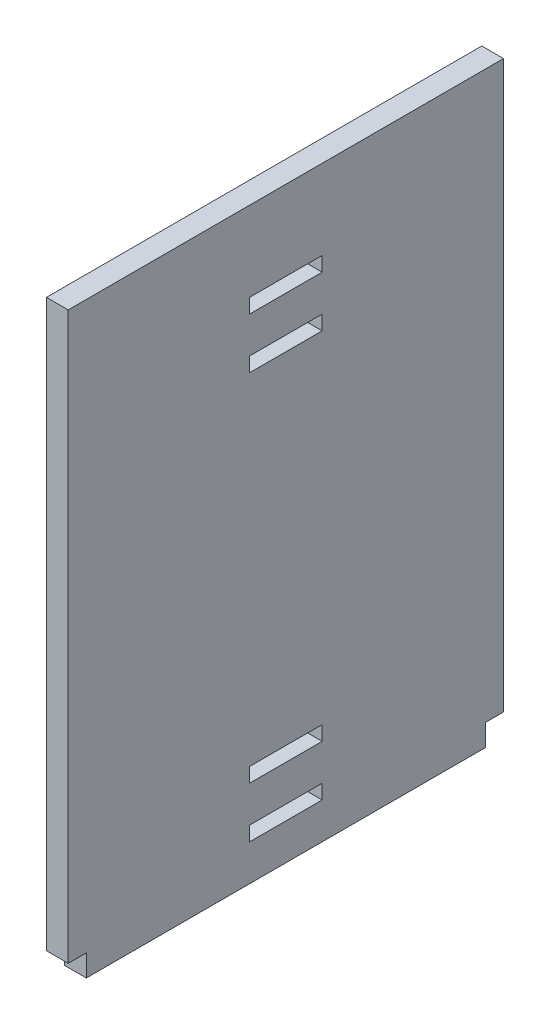
ISO-10303-21;
HEADER;
FILE_DESCRIPTION(('STEP AP214'),'2;1');
FILE_NAME('part.step','',(''),(''),'','','');
FILE_SCHEMA(('AUTOMOTIVE_DESIGN { 1 0 10303 214 1 1 1 1 }'));
ENDSEC;
DATA;
#1=APPLICATION_CONTEXT('core data for automotive mechanical design processes');
#2=APPLICATION_PROTOCOL_DEFINITION('international standard','automotive_design',2000,#1);
#3=PRODUCT_CONTEXT('',#1,'mechanical');
#4=PRODUCT('Part','Part','',(#3));
#5=PRODUCT_RELATED_PRODUCT_CATEGORY('part','',(#4));
#6=PRODUCT_DEFINITION_FORMATION('','',#4);
#7=PRODUCT_DEFINITION_CONTEXT('part definition',#1,'design');
#8=PRODUCT_DEFINITION('design','',#6,#7);
#9=PRODUCT_DEFINITION_SHAPE('','',#8);
#10=(LENGTH_UNIT() NAMED_UNIT(*) SI_UNIT(.MILLI.,.METRE.));
#11=(NAMED_UNIT(*) PLANE_ANGLE_UNIT() SI_UNIT($,.RADIAN.));
#12=(NAMED_UNIT(*) SI_UNIT($,.STERADIAN.) SOLID_ANGLE_UNIT());
#13=UNCERTAINTY_MEASURE_WITH_UNIT(LENGTH_MEASURE(1.E-05),#10,'distance_accuracy_value','');
#14=(GEOMETRIC_REPRESENTATION_CONTEXT(3) GLOBAL_UNCERTAINTY_ASSIGNED_CONTEXT((#13)) GLOBAL_UNIT_ASSIGNED_CONTEXT((#10,
#11,#12)) REPRESENTATION_CONTEXT('',''));
#15=CARTESIAN_POINT('',(0.,0.,0.));
#16=DIRECTION('',(0.,0.,1.));
#17=DIRECTION('',(1.,0.,0.));
#18=AXIS2_PLACEMENT_3D('',#15,#16,#17);
#19=CARTESIAN_POINT('',(0.,-81.,66.));
#20=DIRECTION('',(0.,0.,-1.));
#21=DIRECTION('',(-1.,0.,0.));
#22=AXIS2_PLACEMENT_3D('',#19,#20,#21);
#23=PLANE('',#22);
#24=DIRECTION('',(-1.,0.,0.));
#25=VECTOR('',#24,1.);
#26=CARTESIAN_POINT('',(0.,-75.,66.));
#27=LINE('',#26,#25);
#28=CARTESIAN_POINT('',(6.,-75.,66.));
#29=VERTEX_POINT('',#28);
#30=CARTESIAN_POINT('',(0.,-75.,66.));
#31=VERTEX_POINT('',#30);
#32=EDGE_CURVE('E11',#29,#31,#27,.T.);
#33=ORIENTED_EDGE('',*,*,#32,.F.);
#34=DIRECTION('',(0.,1.,0.));
#35=VECTOR('',#34,1.);
#36=CARTESIAN_POINT('',(6.,-81.,66.));
#37=LINE('',#36,#35);
#38=CARTESIAN_POINT('',(6.,81.,66.));
#39=VERTEX_POINT('',#38);
#40=EDGE_CURVE('E368',#29,#39,#37,.T.);
#41=ORIENTED_EDGE('',*,*,#40,.T.);
#42=DIRECTION('',(-1.,0.,0.));
#43=VECTOR('',#42,1.);
#44=CARTESIAN_POINT('',(0.,81.,66.));
#45=LINE('',#44,#43);
#46=CARTESIAN_POINT('',(0.,81.,66.));
#47=VERTEX_POINT('',#46);
#48=EDGE_CURVE('E341',#39,#47,#45,.T.);
#49=ORIENTED_EDGE('',*,*,#48,.T.);
#50=DIRECTION('',(0.,1.,0.));
#51=VECTOR('',#50,1.);
#52=CARTESIAN_POINT('',(0.,-81.,66.));
#53=LINE('',#52,#51);
#54=EDGE_CURVE('E361',#31,#47,#53,.T.);
#55=ORIENTED_EDGE('',*,*,#54,.F.);
#56=EDGE_LOOP('',(#33,#41,#49,#55));
#57=FACE_BOUND('',#56,.T.);
#58=ADVANCED_FACE('F33',(#57),#23,.F.);
#59=CARTESIAN_POINT('',(6.,81.,67.5));
#60=DIRECTION('',(0.,-1.,0.));
#61=DIRECTION('',(0.,0.,-1.));
#62=AXIS2_PLACEMENT_3D('',#59,#60,#61);
#63=PLANE('',#62);
#64=DIRECTION('',(0.,0.,1.));
#65=VECTOR('',#64,1.);
#66=CARTESIAN_POINT('',(6.,81.,67.5));
#67=LINE('',#66,#65);
#68=CARTESIAN_POINT('',(6.,81.,-54.));
#69=VERTEX_POINT('',#68);
#70=EDGE_CURVE('E371',#69,#39,#67,.T.);
#71=ORIENTED_EDGE('',*,*,#70,.F.);
#72=DIRECTION('',(1.,0.,0.));
#73=VECTOR('',#72,1.);
#74=CARTESIAN_POINT('',(6.,81.,-54.));
#75=LINE('',#74,#73);
#76=CARTESIAN_POINT('',(0.,81.,-54.));
#77=VERTEX_POINT('',#76);
#78=EDGE_CURVE('E357',#77,#69,#75,.T.);
#79=ORIENTED_EDGE('',*,*,#78,.F.);
#80=DIRECTION('',(0.,0.,1.));
#81=VECTOR('',#80,1.);
#82=CARTESIAN_POINT('',(0.,81.,67.5));
#83=LINE('',#82,#81);
#84=EDGE_CURVE('E364',#77,#47,#83,.T.);
#85=ORIENTED_EDGE('',*,*,#84,.T.);
#86=ORIENTED_EDGE('',*,*,#48,.F.);
#87=EDGE_LOOP('',(#71,#79,#85,#86));
#88=FACE_BOUND('',#87,.T.);
#89=ADVANCED_FACE('F35',(#88),#63,.F.);
#90=CARTESIAN_POINT('',(6.,-81.,67.5));
#91=DIRECTION('',(0.,1.,0.));
#92=DIRECTION('',(0.,0.,1.));
#93=AXIS2_PLACEMENT_3D('',#90,#91,#92);
#94=PLANE('',#93);
#95=DIRECTION('',(0.,0.,-1.));
#96=VECTOR('',#95,1.);
#97=CARTESIAN_POINT('',(6.,-81.,67.5));
#98=LINE('',#97,#96);
#99=CARTESIAN_POINT('',(6.,-81.,61.));
#100=VERTEX_POINT('',#99);
#101=CARTESIAN_POINT('',(6.,-81.,-49.));
#102=VERTEX_POINT('',#101);
#103=EDGE_CURVE('E41',#100,#102,#98,.T.);
#104=ORIENTED_EDGE('',*,*,#103,.F.);
#105=DIRECTION('',(1.,0.,0.));
#106=VECTOR('',#105,1.);
#107=CARTESIAN_POINT('',(0.,-81.,61.));
#108=LINE('',#107,#106);
#109=CARTESIAN_POINT('',(0.,-81.,61.));
#110=VERTEX_POINT('',#109);
#111=EDGE_CURVE('E330',#110,#100,#108,.T.);
#112=ORIENTED_EDGE('',*,*,#111,.F.);
#113=DIRECTION('',(0.,0.,-1.));
#114=VECTOR('',#113,1.);
#115=CARTESIAN_POINT('',(0.,-81.,67.5));
#116=LINE('',#115,#114);
#117=CARTESIAN_POINT('',(0.,-81.,-49.));
#118=VERTEX_POINT('',#117);
#119=EDGE_CURVE('E374',#110,#118,#116,.T.);
#120=ORIENTED_EDGE('',*,*,#119,.T.);
#121=DIRECTION('',(-1.,0.,0.));
#122=VECTOR('',#121,1.);
#123=CARTESIAN_POINT('',(0.,-81.,-49.));
#124=LINE('',#123,#122);
#125=EDGE_CURVE('E230',#102,#118,#124,.T.);
#126=ORIENTED_EDGE('',*,*,#125,.F.);
#127=EDGE_LOOP('',(#104,#112,#120,#126));
#128=FACE_BOUND('',#127,.T.);
#129=ADVANCED_FACE('F384',(#128),#94,.F.);
#130=CARTESIAN_POINT('',(6.,0.,0.));
#131=DIRECTION('',(1.,0.,0.));
#132=DIRECTION('',(0.,0.,-1.));
#133=AXIS2_PLACEMENT_3D('',#130,#131,#132);
#134=PLANE('',#133);
#135=DIRECTION('',(0.,-1.,0.));
#136=VECTOR('',#135,1.);
#137=CARTESIAN_POINT('',(6.,-71.,16.));
#138=LINE('',#137,#136);
#139=CARTESIAN_POINT('',(6.,-67.,16.));
#140=VERTEX_POINT('',#139);
#141=CARTESIAN_POINT('',(6.,-71.,16.));
#142=VERTEX_POINT('',#141);
#143=EDGE_CURVE('E48',#140,#142,#138,.T.);
#144=ORIENTED_EDGE('',*,*,#143,.F.);
#145=DIRECTION('',(0.,0.,1.));
#146=VECTOR('',#145,1.);
#147=CARTESIAN_POINT('',(6.,-67.,16.));
#148=LINE('',#147,#146);
#149=CARTESIAN_POINT('',(6.,-67.,-4.));
#150=VERTEX_POINT('',#149);
#151=EDGE_CURVE('E214',#150,#140,#148,.T.);
#152=ORIENTED_EDGE('',*,*,#151,.F.);
#153=DIRECTION('',(0.,1.,0.));
#154=VECTOR('',#153,1.);
#155=CARTESIAN_POINT('',(6.,-71.,-4.));
#156=LINE('',#155,#154);
#157=CARTESIAN_POINT('',(6.,-71.,-4.));
#158=VERTEX_POINT('',#157);
#159=EDGE_CURVE('E217',#158,#150,#156,.T.);
#160=ORIENTED_EDGE('',*,*,#159,.F.);
#161=DIRECTION('',(0.,0.,-1.));
#162=VECTOR('',#161,1.);
#163=CARTESIAN_POINT('',(6.,-71.,16.));
#164=LINE('',#163,#162);
#165=EDGE_CURVE('E223',#142,#158,#164,.T.);
#166=ORIENTED_EDGE('',*,*,#165,.F.);
#167=EDGE_LOOP('',(#144,#152,#160,#166));
#168=FACE_BOUND('',#167,.T.);
#169=DIRECTION('',(0.,-1.,0.));
#170=VECTOR('',#169,1.);
#171=CARTESIAN_POINT('',(6.,-57.,16.0000000000001));
#172=LINE('',#171,#170);
#173=CARTESIAN_POINT('',(6.,-53.,16.0000000000001));
#174=VERTEX_POINT('',#173);
#175=CARTESIAN_POINT('',(6.,-57.,16.0000000000001));
#176=VERTEX_POINT('',#175);
#177=EDGE_CURVE('E56',#174,#176,#172,.T.);
#178=ORIENTED_EDGE('',*,*,#177,.F.);
#179=DIRECTION('',(0.,0.,1.));
#180=VECTOR('',#179,1.);
#181=CARTESIAN_POINT('',(6.,-53.,16.0000000000001));
#182=LINE('',#181,#180);
#183=CARTESIAN_POINT('',(6.,-53.,-3.99999999999995));
#184=VERTEX_POINT('',#183);
#185=EDGE_CURVE('E238',#184,#174,#182,.T.);
#186=ORIENTED_EDGE('',*,*,#185,.F.);
#187=DIRECTION('',(0.,1.,0.));
#188=VECTOR('',#187,1.);
#189=CARTESIAN_POINT('',(6.,-57.,-3.99999999999995));
#190=LINE('',#189,#188);
#191=CARTESIAN_POINT('',(6.,-57.,-3.99999999999995));
#192=VERTEX_POINT('',#191);
#193=EDGE_CURVE('E253',#192,#184,#190,.T.);
#194=ORIENTED_EDGE('',*,*,#193,.F.);
#195=DIRECTION('',(0.,0.,-1.));
#196=VECTOR('',#195,1.);
#197=CARTESIAN_POINT('',(6.,-57.,16.0000000000001));
#198=LINE('',#197,#196);
#199=EDGE_CURVE('E249',#176,#192,#198,.T.);
#200=ORIENTED_EDGE('',*,*,#199,.F.);
#201=EDGE_LOOP('',(#178,#186,#194,#200));
#202=FACE_BOUND('',#201,.T.);
#203=DIRECTION('',(0.,-1.,0.));
#204=VECTOR('',#203,1.);
#205=CARTESIAN_POINT('',(6.,40.9999999999998,16.0000000000004));
#206=LINE('',#205,#204);
#207=CARTESIAN_POINT('',(6.,44.9999999999998,16.0000000000004));
#208=VERTEX_POINT('',#207);
#209=CARTESIAN_POINT('',(6.,40.9999999999998,16.0000000000004));
#210=VERTEX_POINT('',#209);
#211=EDGE_CURVE('E278',#208,#210,#206,.T.);
#212=ORIENTED_EDGE('',*,*,#211,.F.);
#213=DIRECTION('',(0.,0.,1.));
#214=VECTOR('',#213,1.);
#215=CARTESIAN_POINT('',(6.,44.9999999999998,16.0000000000004));
#216=LINE('',#215,#214);
#217=CARTESIAN_POINT('',(6.,44.9999999999998,-3.99999999999961));
#218=VERTEX_POINT('',#217);
#219=EDGE_CURVE('E268',#218,#208,#216,.T.);
#220=ORIENTED_EDGE('',*,*,#219,.F.);
#221=DIRECTION('',(0.,1.,0.));
#222=VECTOR('',#221,1.);
#223=CARTESIAN_POINT('',(6.,40.9999999999998,-3.99999999999961));
#224=LINE('',#223,#222);
#225=CARTESIAN_POINT('',(6.,40.9999999999998,-3.99999999999961));
#226=VERTEX_POINT('',#225);
#227=EDGE_CURVE('E284',#226,#218,#224,.T.);
#228=ORIENTED_EDGE('',*,*,#227,.F.);
#229=DIRECTION('',(0.,0.,-1.));
#230=VECTOR('',#229,1.);
#231=CARTESIAN_POINT('',(6.,40.9999999999998,16.0000000000004));
#232=LINE('',#231,#230);
#233=EDGE_CURVE('E280',#210,#226,#232,.T.);
#234=ORIENTED_EDGE('',*,*,#233,.F.);
#235=EDGE_LOOP('',(#212,#220,#228,#234));
#236=FACE_BOUND('',#235,.T.);
#237=DIRECTION('',(0.,-1.,0.));
#238=VECTOR('',#237,1.);
#239=CARTESIAN_POINT('',(6.,54.9999999999998,16.0000000000004));
#240=LINE('',#239,#238);
#241=CARTESIAN_POINT('',(6.,58.9999999999998,16.0000000000004));
#242=VERTEX_POINT('',#241);
#243=CARTESIAN_POINT('',(6.,54.9999999999998,16.0000000000004));
#244=VERTEX_POINT('',#243);
#245=EDGE_CURVE('E310',#242,#244,#240,.T.);
#246=ORIENTED_EDGE('',*,*,#245,.F.);
#247=DIRECTION('',(0.,0.,1.));
#248=VECTOR('',#247,1.);
#249=CARTESIAN_POINT('',(6.,58.9999999999998,16.0000000000004));
#250=LINE('',#249,#248);
#251=CARTESIAN_POINT('',(6.,58.9999999999998,-3.99999999999956));
#252=VERTEX_POINT('',#251);
#253=EDGE_CURVE('E300',#252,#242,#250,.T.);
#254=ORIENTED_EDGE('',*,*,#253,.F.);
#255=DIRECTION('',(0.,1.,0.));
#256=VECTOR('',#255,1.);
#257=CARTESIAN_POINT('',(6.,54.9999999999998,-3.99999999999956));
#258=LINE('',#257,#256);
#259=CARTESIAN_POINT('',(6.,54.9999999999998,-3.99999999999956));
#260=VERTEX_POINT('',#259);
#261=EDGE_CURVE('E315',#260,#252,#258,.T.);
#262=ORIENTED_EDGE('',*,*,#261,.F.);
#263=DIRECTION('',(0.,0.,-1.));
#264=VECTOR('',#263,1.);
#265=CARTESIAN_POINT('',(6.,54.9999999999998,16.0000000000004));
#266=LINE('',#265,#264);
#267=EDGE_CURVE('E312',#244,#260,#266,.T.);
#268=ORIENTED_EDGE('',*,*,#267,.F.);
#269=EDGE_LOOP('',(#246,#254,#262,#268));
#270=FACE_BOUND('',#269,.T.);
#271=DIRECTION('',(0.,-1.,0.));
#272=VECTOR('',#271,1.);
#273=CARTESIAN_POINT('',(6.,-75.,61.));
#274=LINE('',#273,#272);
#275=CARTESIAN_POINT('',(6.,-75.,61.));
#276=VERTEX_POINT('',#275);
#277=EDGE_CURVE('E338',#276,#100,#274,.T.);
#278=ORIENTED_EDGE('',*,*,#277,.T.);
#279=ORIENTED_EDGE('',*,*,#103,.T.);
#280=DIRECTION('',(0.,-1.,0.));
#281=VECTOR('',#280,1.);
#282=CARTESIAN_POINT('',(6.,-75.,-49.));
#283=LINE('',#282,#281);
#284=CARTESIAN_POINT('',(6.,-75.,-49.));
#285=VERTEX_POINT('',#284);
#286=EDGE_CURVE('E352',#285,#102,#283,.T.);
#287=ORIENTED_EDGE('',*,*,#286,.F.);
#288=DIRECTION('',(0.,0.,1.));
#289=VECTOR('',#288,1.);
#290=CARTESIAN_POINT('',(6.,-75.,-54.));
#291=LINE('',#290,#289);
#292=CARTESIAN_POINT('',(6.,-75.,-54.));
#293=VERTEX_POINT('',#292);
#294=EDGE_CURVE('E347',#293,#285,#291,.T.);
#295=ORIENTED_EDGE('',*,*,#294,.F.);
#296=DIRECTION('',(0.,1.,0.));
#297=VECTOR('',#296,1.);
#298=CARTESIAN_POINT('',(6.,-81.,-54.));
#299=LINE('',#298,#297);
#300=EDGE_CURVE('E362',#293,#69,#299,.T.);
#301=ORIENTED_EDGE('',*,*,#300,.T.);
#302=ORIENTED_EDGE('',*,*,#70,.T.);
#303=ORIENTED_EDGE('',*,*,#40,.F.);
#304=DIRECTION('',(0.,0.,1.));
#305=VECTOR('',#304,1.);
#306=CARTESIAN_POINT('',(6.,-75.,67.5));
#307=LINE('',#306,#305);
#308=EDGE_CURVE('E333',#276,#29,#307,.T.);
#309=ORIENTED_EDGE('',*,*,#308,.F.);
#310=EDGE_LOOP('',(#278,#279,#287,#295,#301,#302,#303,#309));
#311=FACE_BOUND('',#310,.T.);
#312=ADVANCED_FACE('F400',(#168,#202,#236,#270,#311),#134,.T.);
#313=CARTESIAN_POINT('',(0.,0.,0.));
#314=DIRECTION('',(1.,0.,0.));
#315=DIRECTION('',(0.,0.,-1.));
#316=AXIS2_PLACEMENT_3D('',#313,#314,#315);
#317=PLANE('',#316);
#318=DIRECTION('',(0.,0.,1.));
#319=VECTOR('',#318,1.);
#320=CARTESIAN_POINT('',(0.,-67.,16.));
#321=LINE('',#320,#319);
#322=CARTESIAN_POINT('',(0.,-67.,-4.));
#323=VERTEX_POINT('',#322);
#324=CARTESIAN_POINT('',(0.,-67.,16.));
#325=VERTEX_POINT('',#324);
#326=EDGE_CURVE('E201',#323,#325,#321,.T.);
#327=ORIENTED_EDGE('',*,*,#326,.T.);
#328=DIRECTION('',(0.,-1.,0.));
#329=VECTOR('',#328,1.);
#330=CARTESIAN_POINT('',(0.,-71.,16.));
#331=LINE('',#330,#329);
#332=CARTESIAN_POINT('',(0.,-71.,16.));
#333=VERTEX_POINT('',#332);
#334=EDGE_CURVE('E195',#325,#333,#331,.T.);
#335=ORIENTED_EDGE('',*,*,#334,.T.);
#336=DIRECTION('',(0.,0.,-1.));
#337=VECTOR('',#336,1.);
#338=CARTESIAN_POINT('',(0.,-71.,16.));
#339=LINE('',#338,#337);
#340=CARTESIAN_POINT('',(0.,-71.,-4.));
#341=VERTEX_POINT('',#340);
#342=EDGE_CURVE('E205',#333,#341,#339,.T.);
#343=ORIENTED_EDGE('',*,*,#342,.T.);
#344=DIRECTION('',(0.,1.,0.));
#345=VECTOR('',#344,1.);
#346=CARTESIAN_POINT('',(0.,-71.,-4.));
#347=LINE('',#346,#345);
#348=EDGE_CURVE('E209',#341,#323,#347,.T.);
#349=ORIENTED_EDGE('',*,*,#348,.T.);
#350=EDGE_LOOP('',(#327,#335,#343,#349));
#351=FACE_BOUND('',#350,.T.);
#352=DIRECTION('',(0.,0.,1.));
#353=VECTOR('',#352,1.);
#354=CARTESIAN_POINT('',(0.,-53.,16.0000000000001));
#355=LINE('',#354,#353);
#356=CARTESIAN_POINT('',(0.,-53.,-3.99999999999995));
#357=VERTEX_POINT('',#356);
#358=CARTESIAN_POINT('',(0.,-53.,16.0000000000001));
#359=VERTEX_POINT('',#358);
#360=EDGE_CURVE('E244',#357,#359,#355,.T.);
#361=ORIENTED_EDGE('',*,*,#360,.T.);
#362=DIRECTION('',(0.,-1.,0.));
#363=VECTOR('',#362,1.);
#364=CARTESIAN_POINT('',(0.,-57.,16.0000000000001));
#365=LINE('',#364,#363);
#366=CARTESIAN_POINT('',(0.,-57.,16.0000000000001));
#367=VERTEX_POINT('',#366);
#368=EDGE_CURVE('E234',#359,#367,#365,.T.);
#369=ORIENTED_EDGE('',*,*,#368,.T.);
#370=DIRECTION('',(0.,0.,-1.));
#371=VECTOR('',#370,1.);
#372=CARTESIAN_POINT('',(0.,-57.,16.0000000000001));
#373=LINE('',#372,#371);
#374=CARTESIAN_POINT('',(0.,-57.,-3.99999999999995));
#375=VERTEX_POINT('',#374);
#376=EDGE_CURVE('E237',#367,#375,#373,.T.);
#377=ORIENTED_EDGE('',*,*,#376,.T.);
#378=DIRECTION('',(0.,1.,0.));
#379=VECTOR('',#378,1.);
#380=CARTESIAN_POINT('',(0.,-57.,-3.99999999999995));
#381=LINE('',#380,#379);
#382=EDGE_CURVE('E241',#375,#357,#381,.T.);
#383=ORIENTED_EDGE('',*,*,#382,.T.);
#384=EDGE_LOOP('',(#361,#369,#377,#383));
#385=FACE_BOUND('',#384,.T.);
#386=DIRECTION('',(0.,0.,1.));
#387=VECTOR('',#386,1.);
#388=CARTESIAN_POINT('',(0.,44.9999999999998,16.0000000000004));
#389=LINE('',#388,#387);
#390=CARTESIAN_POINT('',(0.,44.9999999999998,-3.99999999999961));
#391=VERTEX_POINT('',#390);
#392=CARTESIAN_POINT('',(0.,44.9999999999998,16.0000000000004));
#393=VERTEX_POINT('',#392);
#394=EDGE_CURVE('E274',#391,#393,#389,.T.);
#395=ORIENTED_EDGE('',*,*,#394,.T.);
#396=DIRECTION('',(0.,-1.,0.));
#397=VECTOR('',#396,1.);
#398=CARTESIAN_POINT('',(0.,40.9999999999998,16.0000000000004));
#399=LINE('',#398,#397);
#400=CARTESIAN_POINT('',(0.,40.9999999999998,16.0000000000004));
#401=VERTEX_POINT('',#400);
#402=EDGE_CURVE('E264',#393,#401,#399,.T.);
#403=ORIENTED_EDGE('',*,*,#402,.T.);
#404=DIRECTION('',(0.,0.,-1.));
#405=VECTOR('',#404,1.);
#406=CARTESIAN_POINT('',(0.,40.9999999999998,16.0000000000004));
#407=LINE('',#406,#405);
#408=CARTESIAN_POINT('',(0.,40.9999999999998,-3.99999999999961));
#409=VERTEX_POINT('',#408);
#410=EDGE_CURVE('E267',#401,#409,#407,.T.);
#411=ORIENTED_EDGE('',*,*,#410,.T.);
#412=DIRECTION('',(0.,1.,0.));
#413=VECTOR('',#412,1.);
#414=CARTESIAN_POINT('',(0.,40.9999999999998,-3.99999999999961));
#415=LINE('',#414,#413);
#416=EDGE_CURVE('E271',#409,#391,#415,.T.);
#417=ORIENTED_EDGE('',*,*,#416,.T.);
#418=EDGE_LOOP('',(#395,#403,#411,#417));
#419=FACE_BOUND('',#418,.T.);
#420=DIRECTION('',(0.,0.,1.));
#421=VECTOR('',#420,1.);
#422=CARTESIAN_POINT('',(0.,58.9999999999998,16.0000000000004));
#423=LINE('',#422,#421);
#424=CARTESIAN_POINT('',(0.,58.9999999999998,-3.99999999999956));
#425=VERTEX_POINT('',#424);
#426=CARTESIAN_POINT('',(0.,58.9999999999998,16.0000000000004));
#427=VERTEX_POINT('',#426);
#428=EDGE_CURVE('E306',#425,#427,#423,.T.);
#429=ORIENTED_EDGE('',*,*,#428,.T.);
#430=DIRECTION('',(0.,-1.,0.));
#431=VECTOR('',#430,1.);
#432=CARTESIAN_POINT('',(0.,54.9999999999998,16.0000000000004));
#433=LINE('',#432,#431);
#434=CARTESIAN_POINT('',(0.,54.9999999999998,16.0000000000004));
#435=VERTEX_POINT('',#434);
#436=EDGE_CURVE('E296',#427,#435,#433,.T.);
#437=ORIENTED_EDGE('',*,*,#436,.T.);
#438=DIRECTION('',(0.,0.,-1.));
#439=VECTOR('',#438,1.);
#440=CARTESIAN_POINT('',(0.,54.9999999999998,16.0000000000004));
#441=LINE('',#440,#439);
#442=CARTESIAN_POINT('',(0.,54.9999999999998,-3.99999999999956));
#443=VERTEX_POINT('',#442);
#444=EDGE_CURVE('E299',#435,#443,#441,.T.);
#445=ORIENTED_EDGE('',*,*,#444,.T.);
#446=DIRECTION('',(0.,1.,0.));
#447=VECTOR('',#446,1.);
#448=CARTESIAN_POINT('',(0.,54.9999999999998,-3.99999999999956));
#449=LINE('',#448,#447);
#450=EDGE_CURVE('E303',#443,#425,#449,.T.);
#451=ORIENTED_EDGE('',*,*,#450,.T.);
#452=EDGE_LOOP('',(#429,#437,#445,#451));
#453=FACE_BOUND('',#452,.T.);
#454=ORIENTED_EDGE('',*,*,#119,.F.);
#455=DIRECTION('',(0.,-1.,0.));
#456=VECTOR('',#455,1.);
#457=CARTESIAN_POINT('',(0.,-75.,61.));
#458=LINE('',#457,#456);
#459=CARTESIAN_POINT('',(0.,-75.,61.));
#460=VERTEX_POINT('',#459);
#461=EDGE_CURVE('E335',#460,#110,#458,.T.);
#462=ORIENTED_EDGE('',*,*,#461,.F.);
#463=DIRECTION('',(0.,0.,-1.));
#464=VECTOR('',#463,1.);
#465=CARTESIAN_POINT('',(0.,-75.,67.5));
#466=LINE('',#465,#464);
#467=EDGE_CURVE('E327',#31,#460,#466,.T.);
#468=ORIENTED_EDGE('',*,*,#467,.F.);
#469=ORIENTED_EDGE('',*,*,#54,.T.);
#470=ORIENTED_EDGE('',*,*,#84,.F.);
#471=DIRECTION('',(0.,1.,0.));
#472=VECTOR('',#471,1.);
#473=CARTESIAN_POINT('',(0.,-81.,-54.));
#474=LINE('',#473,#472);
#475=CARTESIAN_POINT('',(0.,-75.,-54.));
#476=VERTEX_POINT('',#475);
#477=EDGE_CURVE('E360',#476,#77,#474,.T.);
#478=ORIENTED_EDGE('',*,*,#477,.F.);
#479=DIRECTION('',(0.,0.,-1.));
#480=VECTOR('',#479,1.);
#481=CARTESIAN_POINT('',(0.,-75.,-54.));
#482=LINE('',#481,#480);
#483=CARTESIAN_POINT('',(0.,-75.,-49.));
#484=VERTEX_POINT('',#483);
#485=EDGE_CURVE('E343',#484,#476,#482,.T.);
#486=ORIENTED_EDGE('',*,*,#485,.F.);
#487=DIRECTION('',(0.,-1.,0.));
#488=VECTOR('',#487,1.);
#489=CARTESIAN_POINT('',(0.,-75.,-49.));
#490=LINE('',#489,#488);
#491=EDGE_CURVE('E337',#484,#118,#490,.T.);
#492=ORIENTED_EDGE('',*,*,#491,.T.);
#493=EDGE_LOOP('',(#454,#462,#468,#469,#470,#478,#486,#492));
#494=FACE_BOUND('',#493,.T.);
#495=ADVANCED_FACE('F211',(#351,#385,#419,#453,#494),#317,.F.);
#496=CARTESIAN_POINT('',(6.,-81.,-54.));
#497=DIRECTION('',(0.,0.,1.));
#498=DIRECTION('',(1.,0.,0.));
#499=AXIS2_PLACEMENT_3D('',#496,#497,#498);
#500=PLANE('',#499);
#501=ORIENTED_EDGE('',*,*,#300,.F.);
#502=DIRECTION('',(1.,0.,0.));
#503=VECTOR('',#502,1.);
#504=CARTESIAN_POINT('',(0.,-75.,-54.));
#505=LINE('',#504,#503);
#506=EDGE_CURVE('E345',#476,#293,#505,.T.);
#507=ORIENTED_EDGE('',*,*,#506,.F.);
#508=ORIENTED_EDGE('',*,*,#477,.T.);
#509=ORIENTED_EDGE('',*,*,#78,.T.);
#510=EDGE_LOOP('',(#501,#507,#508,#509));
#511=FACE_BOUND('',#510,.T.);
#512=ADVANCED_FACE('F402',(#511),#500,.F.);
#513=CARTESIAN_POINT('',(0.,-75.,-49.));
#514=DIRECTION('',(0.,0.,1.));
#515=DIRECTION('',(1.,0.,0.));
#516=AXIS2_PLACEMENT_3D('',#513,#514,#515);
#517=PLANE('',#516);
#518=ORIENTED_EDGE('',*,*,#125,.T.);
#519=ORIENTED_EDGE('',*,*,#491,.F.);
#520=DIRECTION('',(-1.,0.,0.));
#521=VECTOR('',#520,1.);
#522=CARTESIAN_POINT('',(0.,-75.,-49.));
#523=LINE('',#522,#521);
#524=EDGE_CURVE('E349',#285,#484,#523,.T.);
#525=ORIENTED_EDGE('',*,*,#524,.F.);
#526=ORIENTED_EDGE('',*,*,#286,.T.);
#527=EDGE_LOOP('',(#518,#519,#525,#526));
#528=FACE_BOUND('',#527,.T.);
#529=ADVANCED_FACE('F392',(#528),#517,.F.);
#530=CARTESIAN_POINT('',(0.,-75.,0.));
#531=DIRECTION('',(0.,1.,0.));
#532=DIRECTION('',(0.,0.,1.));
#533=AXIS2_PLACEMENT_3D('',#530,#531,#532);
#534=PLANE('',#533);
#535=ORIENTED_EDGE('',*,*,#485,.T.);
#536=ORIENTED_EDGE('',*,*,#506,.T.);
#537=ORIENTED_EDGE('',*,*,#294,.T.);
#538=ORIENTED_EDGE('',*,*,#524,.T.);
#539=EDGE_LOOP('',(#535,#536,#537,#538));
#540=FACE_BOUND('',#539,.T.);
#541=ADVANCED_FACE('F395',(#540),#534,.F.);
#542=CARTESIAN_POINT('',(0.,-75.,0.));
#543=DIRECTION('',(0.,-1.,0.));
#544=DIRECTION('',(0.,0.,-1.));
#545=AXIS2_PLACEMENT_3D('',#542,#543,#544);
#546=PLANE('',#545);
#547=ORIENTED_EDGE('',*,*,#32,.T.);
#548=ORIENTED_EDGE('',*,*,#467,.T.);
#549=DIRECTION('',(1.,0.,0.));
#550=VECTOR('',#549,1.);
#551=CARTESIAN_POINT('',(0.,-75.,61.));
#552=LINE('',#551,#550);
#553=EDGE_CURVE('E329',#460,#276,#552,.T.);
#554=ORIENTED_EDGE('',*,*,#553,.T.);
#555=ORIENTED_EDGE('',*,*,#308,.T.);
#556=EDGE_LOOP('',(#547,#548,#554,#555));
#557=FACE_BOUND('',#556,.T.);
#558=ADVANCED_FACE('F414',(#557),#546,.T.);
#559=CARTESIAN_POINT('',(0.,-75.,61.));
#560=DIRECTION('',(0.,0.,-1.));
#561=DIRECTION('',(-1.,0.,0.));
#562=AXIS2_PLACEMENT_3D('',#559,#560,#561);
#563=PLANE('',#562);
#564=ORIENTED_EDGE('',*,*,#111,.T.);
#565=ORIENTED_EDGE('',*,*,#277,.F.);
#566=ORIENTED_EDGE('',*,*,#553,.F.);
#567=ORIENTED_EDGE('',*,*,#461,.T.);
#568=EDGE_LOOP('',(#564,#565,#566,#567));
#569=FACE_BOUND('',#568,.T.);
#570=ADVANCED_FACE('F417',(#569),#563,.F.);
#571=CARTESIAN_POINT('',(0.,54.9999999999998,16.0000000000004));
#572=DIRECTION('',(0.,0.,1.));
#573=DIRECTION('',(1.,0.,0.));
#574=AXIS2_PLACEMENT_3D('',#571,#572,#573);
#575=PLANE('',#574);
#576=ORIENTED_EDGE('',*,*,#245,.T.);
#577=DIRECTION('',(1.,0.,0.));
#578=VECTOR('',#577,1.);
#579=CARTESIAN_POINT('',(0.,54.9999999999998,16.0000000000004));
#580=LINE('',#579,#578);
#581=EDGE_CURVE('E309',#435,#244,#580,.T.);
#582=ORIENTED_EDGE('',*,*,#581,.F.);
#583=ORIENTED_EDGE('',*,*,#436,.F.);
#584=DIRECTION('',(1.,0.,0.));
#585=VECTOR('',#584,1.);
#586=CARTESIAN_POINT('',(0.,58.9999999999998,16.0000000000004));
#587=LINE('',#586,#585);
#588=EDGE_CURVE('E281',#427,#242,#587,.T.);
#589=ORIENTED_EDGE('',*,*,#588,.T.);
#590=EDGE_LOOP('',(#576,#582,#583,#589));
#591=FACE_BOUND('',#590,.T.);
#592=ADVANCED_FACE('F419',(#591),#575,.F.);
#593=CARTESIAN_POINT('',(0.,58.9999999999998,16.0000000000004));
#594=DIRECTION('',(0.,1.,0.));
#595=DIRECTION('',(0.,0.,1.));
#596=AXIS2_PLACEMENT_3D('',#593,#594,#595);
#597=PLANE('',#596);
#598=ORIENTED_EDGE('',*,*,#253,.T.);
#599=ORIENTED_EDGE('',*,*,#588,.F.);
#600=ORIENTED_EDGE('',*,*,#428,.F.);
#601=DIRECTION('',(1.,0.,0.));
#602=VECTOR('',#601,1.);
#603=CARTESIAN_POINT('',(0.,58.9999999999998,-3.99999999999956));
#604=LINE('',#603,#602);
#605=EDGE_CURVE('E321',#425,#252,#604,.T.);
#606=ORIENTED_EDGE('',*,*,#605,.T.);
#607=EDGE_LOOP('',(#598,#599,#600,#606));
#608=FACE_BOUND('',#607,.T.);
#609=ADVANCED_FACE('F425',(#608),#597,.F.);
#610=CARTESIAN_POINT('',(0.,54.9999999999998,-3.99999999999956));
#611=DIRECTION('',(0.,0.,-1.));
#612=DIRECTION('',(-1.,0.,0.));
#613=AXIS2_PLACEMENT_3D('',#610,#611,#612);
#614=PLANE('',#613);
#615=ORIENTED_EDGE('',*,*,#261,.T.);
#616=ORIENTED_EDGE('',*,*,#605,.F.);
#617=ORIENTED_EDGE('',*,*,#450,.F.);
#618=DIRECTION('',(1.,0.,0.));
#619=VECTOR('',#618,1.);
#620=CARTESIAN_POINT('',(0.,54.9999999999998,-3.99999999999956));
#621=LINE('',#620,#619);
#622=EDGE_CURVE('E323',#443,#260,#621,.T.);
#623=ORIENTED_EDGE('',*,*,#622,.T.);
#624=EDGE_LOOP('',(#615,#616,#617,#623));
#625=FACE_BOUND('',#624,.T.);
#626=ADVANCED_FACE('F493',(#625),#614,.F.);
#627=CARTESIAN_POINT('',(0.,54.9999999999998,16.0000000000004));
#628=DIRECTION('',(0.,-1.,0.));
#629=DIRECTION('',(0.,0.,-1.));
#630=AXIS2_PLACEMENT_3D('',#627,#628,#629);
#631=PLANE('',#630);
#632=ORIENTED_EDGE('',*,*,#267,.T.);
#633=ORIENTED_EDGE('',*,*,#622,.F.);
#634=ORIENTED_EDGE('',*,*,#444,.F.);
#635=ORIENTED_EDGE('',*,*,#581,.T.);
#636=EDGE_LOOP('',(#632,#633,#634,#635));
#637=FACE_BOUND('',#636,.T.);
#638=ADVANCED_FACE('F502',(#637),#631,.F.);
#639=CARTESIAN_POINT('',(0.,40.9999999999998,16.0000000000004));
#640=DIRECTION('',(0.,0.,1.));
#641=DIRECTION('',(1.,0.,0.));
#642=AXIS2_PLACEMENT_3D('',#639,#640,#641);
#643=PLANE('',#642);
#644=ORIENTED_EDGE('',*,*,#211,.T.);
#645=DIRECTION('',(1.,0.,0.));
#646=VECTOR('',#645,1.);
#647=CARTESIAN_POINT('',(0.,40.9999999999998,16.0000000000004));
#648=LINE('',#647,#646);
#649=EDGE_CURVE('E277',#401,#210,#648,.T.);
#650=ORIENTED_EDGE('',*,*,#649,.F.);
#651=ORIENTED_EDGE('',*,*,#402,.F.);
#652=DIRECTION('',(1.,0.,0.));
#653=VECTOR('',#652,1.);
#654=CARTESIAN_POINT('',(0.,44.9999999999998,16.0000000000004));
#655=LINE('',#654,#653);
#656=EDGE_CURVE('E250',#393,#208,#655,.T.);
#657=ORIENTED_EDGE('',*,*,#656,.T.);
#658=EDGE_LOOP('',(#644,#650,#651,#657));
#659=FACE_BOUND('',#658,.T.);
#660=ADVANCED_FACE('F511',(#659),#643,.F.);
#661=CARTESIAN_POINT('',(0.,44.9999999999998,16.0000000000004));
#662=DIRECTION('',(0.,1.,0.));
#663=DIRECTION('',(0.,0.,1.));
#664=AXIS2_PLACEMENT_3D('',#661,#662,#663);
#665=PLANE('',#664);
#666=ORIENTED_EDGE('',*,*,#219,.T.);
#667=ORIENTED_EDGE('',*,*,#656,.F.);
#668=ORIENTED_EDGE('',*,*,#394,.F.);
#669=DIRECTION('',(1.,0.,0.));
#670=VECTOR('',#669,1.);
#671=CARTESIAN_POINT('',(0.,44.9999999999998,-3.99999999999961));
#672=LINE('',#671,#670);
#673=EDGE_CURVE('E290',#391,#218,#672,.T.);
#674=ORIENTED_EDGE('',*,*,#673,.T.);
#675=EDGE_LOOP('',(#666,#667,#668,#674));
#676=FACE_BOUND('',#675,.T.);
#677=ADVANCED_FACE('F520',(#676),#665,.F.);
#678=CARTESIAN_POINT('',(0.,40.9999999999998,-3.99999999999961));
#679=DIRECTION('',(0.,0.,-1.));
#680=DIRECTION('',(-1.,0.,0.));
#681=AXIS2_PLACEMENT_3D('',#678,#679,#680);
#682=PLANE('',#681);
#683=ORIENTED_EDGE('',*,*,#227,.T.);
#684=ORIENTED_EDGE('',*,*,#673,.F.);
#685=ORIENTED_EDGE('',*,*,#416,.F.);
#686=DIRECTION('',(1.,0.,0.));
#687=VECTOR('',#686,1.);
#688=CARTESIAN_POINT('',(0.,40.9999999999998,-3.99999999999961));
#689=LINE('',#688,#687);
#690=EDGE_CURVE('E292',#409,#226,#689,.T.);
#691=ORIENTED_EDGE('',*,*,#690,.T.);
#692=EDGE_LOOP('',(#683,#684,#685,#691));
#693=FACE_BOUND('',#692,.T.);
#694=ADVANCED_FACE('F529',(#693),#682,.F.);
#695=CARTESIAN_POINT('',(0.,40.9999999999998,16.0000000000004));
#696=DIRECTION('',(0.,-1.,0.));
#697=DIRECTION('',(0.,0.,-1.));
#698=AXIS2_PLACEMENT_3D('',#695,#696,#697);
#699=PLANE('',#698);
#700=ORIENTED_EDGE('',*,*,#233,.T.);
#701=ORIENTED_EDGE('',*,*,#690,.F.);
#702=ORIENTED_EDGE('',*,*,#410,.F.);
#703=ORIENTED_EDGE('',*,*,#649,.T.);
#704=EDGE_LOOP('',(#700,#701,#702,#703));
#705=FACE_BOUND('',#704,.T.);
#706=ADVANCED_FACE('F538',(#705),#699,.F.);
#707=CARTESIAN_POINT('',(0.,-57.,16.0000000000001));
#708=DIRECTION('',(0.,0.,1.));
#709=DIRECTION('',(1.,0.,0.));
#710=AXIS2_PLACEMENT_3D('',#707,#708,#709);
#711=PLANE('',#710);
#712=ORIENTED_EDGE('',*,*,#177,.T.);
#713=DIRECTION('',(1.,0.,0.));
#714=VECTOR('',#713,1.);
#715=CARTESIAN_POINT('',(0.,-57.,16.0000000000001));
#716=LINE('',#715,#714);
#717=EDGE_CURVE('E247',#367,#176,#716,.T.);
#718=ORIENTED_EDGE('',*,*,#717,.F.);
#719=ORIENTED_EDGE('',*,*,#368,.F.);
#720=DIRECTION('',(1.,0.,0.));
#721=VECTOR('',#720,1.);
#722=CARTESIAN_POINT('',(0.,-53.,16.0000000000001));
#723=LINE('',#722,#721);
#724=EDGE_CURVE('E224',#359,#174,#723,.T.);
#725=ORIENTED_EDGE('',*,*,#724,.T.);
#726=EDGE_LOOP('',(#712,#718,#719,#725));
#727=FACE_BOUND('',#726,.T.);
#728=ADVANCED_FACE('F547',(#727),#711,.F.);
#729=CARTESIAN_POINT('',(0.,-53.,16.0000000000001));
#730=DIRECTION('',(0.,1.,0.));
#731=DIRECTION('',(0.,0.,1.));
#732=AXIS2_PLACEMENT_3D('',#729,#730,#731);
#733=PLANE('',#732);
#734=ORIENTED_EDGE('',*,*,#185,.T.);
#735=ORIENTED_EDGE('',*,*,#724,.F.);
#736=ORIENTED_EDGE('',*,*,#360,.F.);
#737=DIRECTION('',(1.,0.,0.));
#738=VECTOR('',#737,1.);
#739=CARTESIAN_POINT('',(0.,-53.,-3.99999999999995));
#740=LINE('',#739,#738);
#741=EDGE_CURVE('E259',#357,#184,#740,.T.);
#742=ORIENTED_EDGE('',*,*,#741,.T.);
#743=EDGE_LOOP('',(#734,#735,#736,#742));
#744=FACE_BOUND('',#743,.T.);
#745=ADVANCED_FACE('F556',(#744),#733,.F.);
#746=CARTESIAN_POINT('',(0.,-57.,-3.99999999999995));
#747=DIRECTION('',(0.,0.,-1.));
#748=DIRECTION('',(-1.,0.,0.));
#749=AXIS2_PLACEMENT_3D('',#746,#747,#748);
#750=PLANE('',#749);
#751=ORIENTED_EDGE('',*,*,#193,.T.);
#752=ORIENTED_EDGE('',*,*,#741,.F.);
#753=ORIENTED_EDGE('',*,*,#382,.F.);
#754=DIRECTION('',(1.,0.,0.));
#755=VECTOR('',#754,1.);
#756=CARTESIAN_POINT('',(0.,-57.,-3.99999999999995));
#757=LINE('',#756,#755);
#758=EDGE_CURVE('E261',#375,#192,#757,.T.);
#759=ORIENTED_EDGE('',*,*,#758,.T.);
#760=EDGE_LOOP('',(#751,#752,#753,#759));
#761=FACE_BOUND('',#760,.T.);
#762=ADVANCED_FACE('F564',(#761),#750,.F.);
#763=CARTESIAN_POINT('',(0.,-57.,16.0000000000001));
#764=DIRECTION('',(0.,-1.,0.));
#765=DIRECTION('',(0.,0.,-1.));
#766=AXIS2_PLACEMENT_3D('',#763,#764,#765);
#767=PLANE('',#766);
#768=ORIENTED_EDGE('',*,*,#199,.T.);
#769=ORIENTED_EDGE('',*,*,#758,.F.);
#770=ORIENTED_EDGE('',*,*,#376,.F.);
#771=ORIENTED_EDGE('',*,*,#717,.T.);
#772=EDGE_LOOP('',(#768,#769,#770,#771));
#773=FACE_BOUND('',#772,.T.);
#774=ADVANCED_FACE('F573',(#773),#767,.F.);
#775=CARTESIAN_POINT('',(0.,-71.,16.));
#776=DIRECTION('',(0.,0.,1.));
#777=DIRECTION('',(1.,0.,0.));
#778=AXIS2_PLACEMENT_3D('',#775,#776,#777);
#779=PLANE('',#778);
#780=ORIENTED_EDGE('',*,*,#143,.T.);
#781=DIRECTION('',(1.,0.,0.));
#782=VECTOR('',#781,1.);
#783=CARTESIAN_POINT('',(0.,-71.,16.));
#784=LINE('',#783,#782);
#785=EDGE_CURVE('E191',#333,#142,#784,.T.);
#786=ORIENTED_EDGE('',*,*,#785,.F.);
#787=ORIENTED_EDGE('',*,*,#334,.F.);
#788=DIRECTION('',(1.,0.,0.));
#789=VECTOR('',#788,1.);
#790=CARTESIAN_POINT('',(0.,-67.,16.));
#791=LINE('',#790,#789);
#792=EDGE_CURVE('E228',#325,#140,#791,.T.);
#793=ORIENTED_EDGE('',*,*,#792,.T.);
#794=EDGE_LOOP('',(#780,#786,#787,#793));
#795=FACE_BOUND('',#794,.T.);
#796=ADVANCED_FACE('F193',(#795),#779,.F.);
#797=CARTESIAN_POINT('',(0.,-67.,16.));
#798=DIRECTION('',(0.,1.,0.));
#799=DIRECTION('',(0.,0.,1.));
#800=AXIS2_PLACEMENT_3D('',#797,#798,#799);
#801=PLANE('',#800);
#802=ORIENTED_EDGE('',*,*,#151,.T.);
#803=ORIENTED_EDGE('',*,*,#792,.F.);
#804=ORIENTED_EDGE('',*,*,#326,.F.);
#805=DIRECTION('',(1.,0.,0.));
#806=VECTOR('',#805,1.);
#807=CARTESIAN_POINT('',(0.,-67.,-4.));
#808=LINE('',#807,#806);
#809=EDGE_CURVE('E231',#323,#150,#808,.T.);
#810=ORIENTED_EDGE('',*,*,#809,.T.);
#811=EDGE_LOOP('',(#802,#803,#804,#810));
#812=FACE_BOUND('',#811,.T.);
#813=ADVANCED_FACE('F590',(#812),#801,.F.);
#814=CARTESIAN_POINT('',(0.,-71.,-4.));
#815=DIRECTION('',(0.,0.,-1.));
#816=DIRECTION('',(-1.,0.,0.));
#817=AXIS2_PLACEMENT_3D('',#814,#815,#816);
#818=PLANE('',#817);
#819=ORIENTED_EDGE('',*,*,#159,.T.);
#820=ORIENTED_EDGE('',*,*,#809,.F.);
#821=ORIENTED_EDGE('',*,*,#348,.F.);
#822=DIRECTION('',(1.,0.,0.));
#823=VECTOR('',#822,1.);
#824=CARTESIAN_POINT('',(0.,-71.,-4.));
#825=LINE('',#824,#823);
#826=EDGE_CURVE('E200',#341,#158,#825,.T.);
#827=ORIENTED_EDGE('',*,*,#826,.T.);
#828=EDGE_LOOP('',(#819,#820,#821,#827));
#829=FACE_BOUND('',#828,.T.);
#830=ADVANCED_FACE('F598',(#829),#818,.F.);
#831=CARTESIAN_POINT('',(0.,-71.,16.));
#832=DIRECTION('',(0.,-1.,0.));
#833=DIRECTION('',(0.,0.,-1.));
#834=AXIS2_PLACEMENT_3D('',#831,#832,#833);
#835=PLANE('',#834);
#836=ORIENTED_EDGE('',*,*,#165,.T.);
#837=ORIENTED_EDGE('',*,*,#826,.F.);
#838=ORIENTED_EDGE('',*,*,#342,.F.);
#839=ORIENTED_EDGE('',*,*,#785,.T.);
#840=EDGE_LOOP('',(#836,#837,#838,#839));
#841=FACE_BOUND('',#840,.T.);
#842=ADVANCED_FACE('F206',(#841),#835,.F.);
#843=CLOSED_SHELL('',(#58,#89,#129,#312,#495,#512,#529,#541,#558,#570,#592,#609,#626,#638,#660,
#677,#694,#706,#728,#745,#762,#774,#796,#813,#830,#842));
#844=MANIFOLD_SOLID_BREP('B2',#843);
#845=ADVANCED_BREP_SHAPE_REPRESENTATION('',(#18,#844),#14);
#846=SHAPE_DEFINITION_REPRESENTATION(#9,#845);
ENDSEC;
END-ISO-10303-21;
